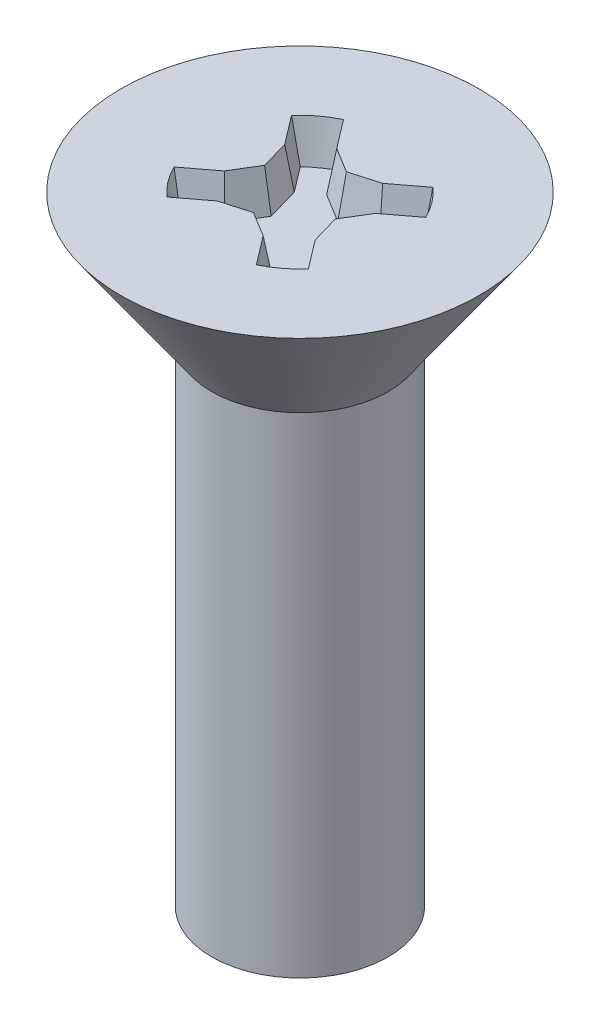
ISO-10303-21;
HEADER;
FILE_DESCRIPTION(('STEP AP214'),'2;1');
FILE_NAME('part.step','',(''),(''),'','','');
FILE_SCHEMA(('AUTOMOTIVE_DESIGN { 1 0 10303 214 1 1 1 1 }'));
ENDSEC;
DATA;
#1=APPLICATION_CONTEXT('core data for automotive mechanical design processes');
#2=APPLICATION_PROTOCOL_DEFINITION('international standard','automotive_design',2000,#1);
#3=PRODUCT_CONTEXT('',#1,'mechanical');
#4=PRODUCT('Part','Part','',(#3));
#5=PRODUCT_RELATED_PRODUCT_CATEGORY('part','',(#4));
#6=PRODUCT_DEFINITION_FORMATION('','',#4);
#7=PRODUCT_DEFINITION_CONTEXT('part definition',#1,'design');
#8=PRODUCT_DEFINITION('design','',#6,#7);
#9=PRODUCT_DEFINITION_SHAPE('','',#8);
#10=(LENGTH_UNIT() NAMED_UNIT(*) SI_UNIT(.MILLI.,.METRE.));
#11=(NAMED_UNIT(*) PLANE_ANGLE_UNIT() SI_UNIT($,.RADIAN.));
#12=(NAMED_UNIT(*) SI_UNIT($,.STERADIAN.) SOLID_ANGLE_UNIT());
#13=UNCERTAINTY_MEASURE_WITH_UNIT(LENGTH_MEASURE(1.E-05),#10,'distance_accuracy_value','');
#14=(GEOMETRIC_REPRESENTATION_CONTEXT(3) GLOBAL_UNCERTAINTY_ASSIGNED_CONTEXT((#13)) GLOBAL_UNIT_ASSIGNED_CONTEXT((#10,
#11,#12)) REPRESENTATION_CONTEXT('',''));
#15=CARTESIAN_POINT('',(0.,0.,0.));
#16=DIRECTION('',(0.,0.,1.));
#17=DIRECTION('',(1.,0.,0.));
#18=AXIS2_PLACEMENT_3D('',#15,#16,#17);
#19=CARTESIAN_POINT('',(-55.3720970236662,4.,26.6733675478979));
#20=DIRECTION('',(0.514943647231245,-0.17364817766693,-0.839451815513635));
#21=DIRECTION('',(0.265146006465246,-0.89898178277291,0.348610598659839));
#22=AXIS2_PLACEMENT_3D('',#19,#20,#21);
#23=PLANE('',#22);
#24=DIRECTION('',(0.852401712868348,0.,0.522887483020111));
#25=VECTOR('',#24,1.);
#26=CARTESIAN_POINT('',(-56.3593550571996,4.,26.0677553577152));
#27=LINE('',#26,#25);
#28=CARTESIAN_POINT('',(-55.3720970236662,4.,26.6733675478979));
#29=VERTEX_POINT('',#28);
#30=CARTESIAN_POINT('',(-54.8935125508018,4.,26.9669448913625));
#31=VERTEX_POINT('',#30);
#32=EDGE_CURVE('E37',#29,#31,#27,.T.);
#33=ORIENTED_EDGE('',*,*,#32,.F.);
#34=DIRECTION('',(-0.118460689054673,-0.984287244785133,0.13094153237985));
#35=VECTOR('',#34,1.);
#36=CARTESIAN_POINT('',(-55.3707765266803,4.01097198024387,26.6719079252989));
#37=LINE('',#36,#35);
#38=CARTESIAN_POINT('',(-55.4638050545667,3.238,26.7747378015531));
#39=VERTEX_POINT('',#38);
#40=EDGE_CURVE('E9',#29,#39,#37,.T.);
#41=ORIENTED_EDGE('',*,*,#40,.T.);
#42=DIRECTION('',(0.852401712868348,0.,0.522887483020111));
#43=VECTOR('',#42,1.);
#44=CARTESIAN_POINT('',(-55.2103705547585,3.238,26.9302017403446));
#45=LINE('',#44,#43);
#46=CARTESIAN_POINT('',(-54.9132976708213,3.238,27.1124347065745));
#47=VERTEX_POINT('',#46);
#48=EDGE_CURVE('E18',#39,#47,#45,.T.);
#49=ORIENTED_EDGE('',*,*,#48,.T.);
#50=DIRECTION('',(-0.0254957226715016,-0.981936963565237,0.187482713095742));
#51=VECTOR('',#50,1.);
#52=CARTESIAN_POINT('',(-54.8929664474664,4.02103251034859,26.9629291222758));
#53=LINE('',#52,#51);
#54=EDGE_CURVE('E389',#31,#47,#53,.T.);
#55=ORIENTED_EDGE('',*,*,#54,.F.);
#56=EDGE_LOOP('',(#33,#41,#49,#55));
#57=FACE_BOUND('',#56,.T.);
#58=ADVANCED_FACE('F14',(#57),#23,.F.);
#59=CARTESIAN_POINT('',(-55.7872635419585,4.,26.1275118874078));
#60=DIRECTION('',(0.78384789512428,-0.17364817766693,-0.596178486446962));
#61=DIRECTION('',(-0.60537550057201,0.,-0.79594001237982));
#62=AXIS2_PLACEMENT_3D('',#59,#60,#61);
#63=PLANE('',#62);
#64=DIRECTION('',(0.60537550057201,0.,0.79594001237982));
#65=VECTOR('',#64,1.);
#66=CARTESIAN_POINT('',(-56.2900299325088,4.,25.466481028477));
#67=LINE('',#66,#65);
#68=CARTESIAN_POINT('',(-55.7872635419585,4.,26.1275118874078));
#69=VERTEX_POINT('',#68);
#70=EDGE_CURVE('E290',#69,#29,#67,.T.);
#71=ORIENTED_EDGE('',*,*,#70,.F.);
#72=CARTESIAN_POINT('',(-55.787263541916,4.00000000000905,26.1275118874622));
#73=CARTESIAN_POINT('',(-55.8081011746266,3.60634389370737,26.2147745648814));
#74=CARTESIAN_POINT('',(-55.8253863471622,3.23800000000013,26.2993353146135));
#75=(BOUNDED_CURVE() B_SPLINE_CURVE(2,(#72,#73,#74),.UNSPECIFIED.,.F.,
.F.) B_SPLINE_CURVE_WITH_KNOTS((3,3),(95.373264001806,95.8888299746063),
.UNSPECIFIED.) CURVE() GEOMETRIC_REPRESENTATION_ITEM() RATIONAL_B_SPLINE_CURVE((1.,1.,1.)) REPRESENTATION_ITEM(''));
#76=CARTESIAN_POINT('',(-55.8253863472247,3.238,26.2993353145304));
#77=VERTEX_POINT('',#76);
#78=EDGE_CURVE('E321',#69,#77,#75,.T.);
#79=ORIENTED_EDGE('',*,*,#78,.T.);
#80=DIRECTION('',(0.60537550057201,0.,0.79594001237982));
#81=VECTOR('',#80,1.);
#82=CARTESIAN_POINT('',(-55.3590570595746,3.238,26.9124591337708));
#83=LINE('',#82,#81);
#84=EDGE_CURVE('E317',#77,#39,#83,.T.);
#85=ORIENTED_EDGE('',*,*,#84,.T.);
#86=ORIENTED_EDGE('',*,*,#40,.F.);
#87=EDGE_LOOP('',(#71,#79,#85,#86));
#88=FACE_BOUND('',#87,.T.);
#89=ADVANCED_FACE('F644',(#88),#63,.F.);
#90=CARTESIAN_POINT('',(-55.,4.,27.75));
#91=DIRECTION('',(0.,1.,0.));
#92=DIRECTION('',(0.436544051213542,0.,0.899682883770758));
#93=AXIS2_PLACEMENT_3D('',#90,#91,#92);
#94=CONICAL_SURFACE('',#93,1.80340000002629,0.1745329252);
#95=CARTESIAN_POINT('',(-55.,4.,27.75));
#96=DIRECTION('',(0.,-1.,0.));
#97=DIRECTION('',(0.436544051213542,0.,0.899682883770758));
#98=AXIS2_PLACEMENT_3D('',#95,#96,#97);
#99=CIRCLE('',#98,1.80340000002629);
#100=CARTESIAN_POINT('',(-56.353336078763,4.,26.5580549434146));
#101=VERTEX_POINT('',#100);
#102=EDGE_CURVE('E224',#101,#69,#99,.T.);
#103=ORIENTED_EDGE('',*,*,#102,.F.);
#104=CARTESIAN_POINT('',(-56.3533360788042,3.99999999999701,26.5580549433653));
#105=CARTESIAN_POINT('',(-56.2636778285467,3.60634389370379,26.5612767390242));
#106=CARTESIAN_POINT('',(-56.1775720384637,3.238,26.5672004623697));
#107=(BOUNDED_CURVE() B_SPLINE_CURVE(2,(#104,#105,#106),.UNSPECIFIED.,.F.,
.F.) B_SPLINE_CURVE_WITH_KNOTS((3,3),(95.3732640012774,95.8888299740268),
.UNSPECIFIED.) CURVE() GEOMETRIC_REPRESENTATION_ITEM() RATIONAL_B_SPLINE_CURVE((1.,1.,1.)) REPRESENTATION_ITEM(''));
#108=CARTESIAN_POINT('',(-56.1775720384362,3.238,26.5672004624001));
#109=VERTEX_POINT('',#108);
#110=EDGE_CURVE('E322',#101,#109,#107,.T.);
#111=ORIENTED_EDGE('',*,*,#110,.T.);
#112=CARTESIAN_POINT('',(-55.,3.238,27.75));
#113=DIRECTION('',(0.,-1.,0.));
#114=DIRECTION('',(0.436544051213542,0.,0.899682883770758));
#115=AXIS2_PLACEMENT_3D('',#112,#113,#114);
#116=CIRCLE('',#115,1.66903884072643);
#117=EDGE_CURVE('E288',#109,#77,#116,.T.);
#118=ORIENTED_EDGE('',*,*,#117,.T.);
#119=ORIENTED_EDGE('',*,*,#78,.F.);
#120=EDGE_LOOP('',(#103,#111,#118,#119));
#121=FACE_BOUND('',#120,.T.);
#122=ADVANCED_FACE('F626',(#121),#94,.F.);
#123=CARTESIAN_POINT('',(-55.9381695604707,4.,27.1039106039047));
#124=DIRECTION('',(-0.78384789512428,-0.173648177666931,0.596178486446962));
#125=DIRECTION('',(-0.13821353268195,0.984807753012208,0.105122352478536));
#126=AXIS2_PLACEMENT_3D('',#123,#124,#125);
#127=PLANE('',#126);
#128=DIRECTION('',(-0.60537550057201,0.,-0.79594001237982));
#129=VECTOR('',#128,1.);
#130=CARTESIAN_POINT('',(-56.6485192101672,4.,26.1699519147289));
#131=LINE('',#130,#129);
#132=CARTESIAN_POINT('',(-55.9381695604707,4.,27.1039106039047));
#133=VERTEX_POINT('',#132);
#134=EDGE_CURVE('E219',#133,#101,#131,.T.);
#135=ORIENTED_EDGE('',*,*,#134,.F.);
#136=DIRECTION('',(0.157820274127082,-0.984287244785133,-0.0791920502812255));
#137=VECTOR('',#136,1.);
#138=CARTESIAN_POINT('',(-55.9396098266512,4.00898259515987,27.104633309732));
#139=LINE('',#138,#137);
#140=CARTESIAN_POINT('',(-55.8159907457782,3.238,27.0426029494227));
#141=VERTEX_POINT('',#140);
#142=EDGE_CURVE('E284',#133,#141,#139,.T.);
#143=ORIENTED_EDGE('',*,*,#142,.T.);
#144=DIRECTION('',(-0.60537550057201,0.,-0.79594001237982));
#145=VECTOR('',#144,1.);
#146=CARTESIAN_POINT('',(-55.50365949164,3.238,27.4532521118855));
#147=LINE('',#146,#145);
#148=EDGE_CURVE('E289',#141,#109,#147,.T.);
#149=ORIENTED_EDGE('',*,*,#148,.T.);
#150=ORIENTED_EDGE('',*,*,#110,.F.);
#151=EDGE_LOOP('',(#135,#143,#149,#150));
#152=FACE_BOUND('',#151,.T.);
#153=ADVANCED_FACE('F602',(#152),#127,.F.);
#154=CARTESIAN_POINT('',(-55.7830551086375,4.,27.6435125508018));
#155=DIRECTION('',(-0.946478332793247,-0.173648177666931,0.27207549677593));
#156=DIRECTION('',(0.276272699868314,0.,0.961079286691516));
#157=AXIS2_PLACEMENT_3D('',#154,#155,#156);
#158=PLANE('',#157);
#159=DIRECTION('',(-0.276272699868314,0.,-0.961079286691515));
#160=VECTOR('',#159,1.);
#161=CARTESIAN_POINT('',(-56.1805934400274,4.,26.2605823657097));
#162=LINE('',#161,#160);
#163=CARTESIAN_POINT('',(-55.7830551086375,4.,27.6435125508018));
#164=VERTEX_POINT('',#163);
#165=EDGE_CURVE('E223',#164,#133,#162,.T.);
#166=ORIENTED_EDGE('',*,*,#165,.F.);
#167=DIRECTION('',(0.187482713095742,-0.981936963565237,0.0254957226715016));
#168=VECTOR('',#167,1.);
#169=CARTESIAN_POINT('',(-55.7870708777242,4.02103251034859,27.6429664474664));
#170=LINE('',#169,#168);
#171=CARTESIAN_POINT('',(-55.6375652934255,3.238,27.6632976708213));
#172=VERTEX_POINT('',#171);
#173=EDGE_CURVE('E341',#164,#172,#170,.T.);
#174=ORIENTED_EDGE('',*,*,#173,.T.);
#175=DIRECTION('',(-0.276272699868314,0.,-0.961079286691515));
#176=VECTOR('',#175,1.);
#177=CARTESIAN_POINT('',(-55.563511649014,3.238,27.9209106155015));
#178=LINE('',#177,#176);
#179=EDGE_CURVE('E337',#172,#141,#178,.T.);
#180=ORIENTED_EDGE('',*,*,#179,.T.);
#181=ORIENTED_EDGE('',*,*,#142,.F.);
#182=EDGE_LOOP('',(#166,#174,#180,#181));
#183=FACE_BOUND('',#182,.T.);
#184=ADVANCED_FACE('F596',(#183),#158,.F.);
#185=CARTESIAN_POINT('',(-53.9233675478979,4.,27.3779029763338));
#186=DIRECTION('',(0.839451815513635,-0.17364817766693,0.514943647231245));
#187=DIRECTION('',(-0.348610598659839,-0.89898178277291,0.265146006465246));
#188=AXIS2_PLACEMENT_3D('',#185,#186,#187);
#189=PLANE('',#188);
#190=DIRECTION('',(-0.522887483020111,0.,0.852401712868347));
#191=VECTOR('',#190,1.);
#192=CARTESIAN_POINT('',(-53.8290175088518,4.,27.2240952499993));
#193=LINE('',#192,#191);
#194=CARTESIAN_POINT('',(-53.9233675478979,4.,27.3779029763338));
#195=VERTEX_POINT('',#194);
#196=CARTESIAN_POINT('',(-54.2169448913625,4.,27.8564874491982));
#197=VERTEX_POINT('',#196);
#198=EDGE_CURVE('E251',#195,#197,#193,.T.);
#199=ORIENTED_EDGE('',*,*,#198,.F.);
#200=DIRECTION('',(-0.13094153237985,-0.984287244785133,-0.118460689054673));
#201=VECTOR('',#200,1.);
#202=CARTESIAN_POINT('',(-53.9219079252989,4.01097198024387,27.3792234733197));
#203=LINE('',#202,#201);
#204=CARTESIAN_POINT('',(-54.0247378015531,3.238,27.2861949454333));
#205=VERTEX_POINT('',#204);
#206=EDGE_CURVE('E342',#195,#205,#203,.T.);
#207=ORIENTED_EDGE('',*,*,#206,.T.);
#208=DIRECTION('',(-0.522887483020111,0.,0.852401712868348));
#209=VECTOR('',#208,1.);
#210=CARTESIAN_POINT('',(-54.4941563865451,3.238,28.0514326282869));
#211=LINE('',#210,#209);
#212=CARTESIAN_POINT('',(-54.3624347065745,3.238,27.8367023291787));
#213=VERTEX_POINT('',#212);
#214=EDGE_CURVE('E420',#205,#213,#211,.T.);
#215=ORIENTED_EDGE('',*,*,#214,.T.);
#216=DIRECTION('',(-0.187482713095742,-0.981936963565237,-0.0254957226715016));
#217=VECTOR('',#216,1.);
#218=CARTESIAN_POINT('',(-54.2129291222758,4.02103251034859,27.8570335525336));
#219=LINE('',#218,#217);
#220=EDGE_CURVE('E255',#197,#213,#219,.T.);
#221=ORIENTED_EDGE('',*,*,#220,.F.);
#222=EDGE_LOOP('',(#199,#207,#215,#221));
#223=FACE_BOUND('',#222,.T.);
#224=ADVANCED_FACE('F601',(#223),#189,.F.);
#225=CARTESIAN_POINT('',(-53.3775118874078,4.,26.9627364580415));
#226=DIRECTION('',(0.596178486446962,-0.17364817766693,0.78384789512428));
#227=DIRECTION('',(-0.79594001237982,0.,0.60537550057201));
#228=AXIS2_PLACEMENT_3D('',#225,#226,#227);
#229=PLANE('',#228);
#230=DIRECTION('',(-0.79594001237982,0.,0.60537550057201));
#231=VECTOR('',#230,1.);
#232=CARTESIAN_POINT('',(-54.0811201797022,4.,27.4978863632219));
#233=LINE('',#232,#231);
#234=CARTESIAN_POINT('',(-53.3775118874078,4.,26.9627364580415));
#235=VERTEX_POINT('',#234);
#236=EDGE_CURVE('E217',#235,#195,#233,.T.);
#237=ORIENTED_EDGE('',*,*,#236,.F.);
#238=CARTESIAN_POINT('',(-53.3775118874605,4.00000000001615,26.9627364580844));
#239=CARTESIAN_POINT('',(-53.4647745648806,3.60634389371063,26.9418988253735));
#240=CARTESIAN_POINT('',(-53.5493353146135,3.238,26.9246136528378));
#241=(BOUNDED_CURVE() B_SPLINE_CURVE(2,(#238,#239,#240),.UNSPECIFIED.,.F.,
.F.) B_SPLINE_CURVE_WITH_KNOTS((3,3),(95.3732640018013,95.8888299746063),
.UNSPECIFIED.) CURVE() GEOMETRIC_REPRESENTATION_ITEM() RATIONAL_B_SPLINE_CURVE((1.,1.,1.)) REPRESENTATION_ITEM(''));
#242=CARTESIAN_POINT('',(-53.5493353145304,3.238,26.9246136527753));
#243=VERTEX_POINT('',#242);
#244=EDGE_CURVE('E246',#235,#243,#241,.T.);
#245=ORIENTED_EDGE('',*,*,#244,.T.);
#246=DIRECTION('',(-0.79594001237982,0.,0.60537550057201));
#247=VECTOR('',#246,1.);
#248=CARTESIAN_POINT('',(-54.5317443540215,3.238,27.6718136361889));
#249=LINE('',#248,#247);
#250=EDGE_CURVE('E242',#243,#205,#249,.T.);
#251=ORIENTED_EDGE('',*,*,#250,.T.);
#252=ORIENTED_EDGE('',*,*,#206,.F.);
#253=EDGE_LOOP('',(#237,#245,#251,#252));
#254=FACE_BOUND('',#253,.T.);
#255=ADVANCED_FACE('F438',(#254),#229,.F.);
#256=CARTESIAN_POINT('',(-55.,4.,27.75));
#257=DIRECTION('',(0.,1.,0.));
#258=DIRECTION('',(-0.899682883770758,0.,0.436544051213542));
#259=AXIS2_PLACEMENT_3D('',#256,#257,#258);
#260=CONICAL_SURFACE('',#259,1.80340000002629,0.1745329252);
#261=CARTESIAN_POINT('',(-55.,4.,27.75));
#262=DIRECTION('',(0.,-1.,0.));
#263=DIRECTION('',(-0.899682883770758,0.,0.436544051213542));
#264=AXIS2_PLACEMENT_3D('',#261,#262,#263);
#265=CIRCLE('',#264,1.80340000002629);
#266=CARTESIAN_POINT('',(-53.8080549434146,4.,26.396663921237));
#267=VERTEX_POINT('',#266);
#268=EDGE_CURVE('E353',#267,#235,#265,.T.);
#269=ORIENTED_EDGE('',*,*,#268,.F.);
#270=CARTESIAN_POINT('',(-53.8080549433641,3.99999999999176,26.396663921196));
#271=CARTESIAN_POINT('',(-53.811276739023,3.60634389370139,26.4863221714528));
#272=CARTESIAN_POINT('',(-53.8172004623684,3.23800000000006,26.5724279615353));
#273=(BOUNDED_CURVE() B_SPLINE_CURVE(2,(#270,#271,#272),.UNSPECIFIED.,.F.,
.F.) B_SPLINE_CURVE_WITH_KNOTS((3,3),(95.3732640012751,95.8888299740206),
.UNSPECIFIED.) CURVE() GEOMETRIC_REPRESENTATION_ITEM() RATIONAL_B_SPLINE_CURVE((1.,1.,1.)) REPRESENTATION_ITEM(''));
#274=CARTESIAN_POINT('',(-53.8172004624001,3.238,26.5724279615638));
#275=VERTEX_POINT('',#274);
#276=EDGE_CURVE('E240',#267,#275,#273,.T.);
#277=ORIENTED_EDGE('',*,*,#276,.T.);
#278=CARTESIAN_POINT('',(-55.,3.238,27.75));
#279=DIRECTION('',(0.,-1.,0.));
#280=DIRECTION('',(-0.899682883770758,0.,0.436544051213542));
#281=AXIS2_PLACEMENT_3D('',#278,#279,#280);
#282=CIRCLE('',#281,1.66903884072643);
#283=EDGE_CURVE('E236',#275,#243,#282,.T.);
#284=ORIENTED_EDGE('',*,*,#283,.T.);
#285=ORIENTED_EDGE('',*,*,#244,.F.);
#286=EDGE_LOOP('',(#269,#277,#284,#285));
#287=FACE_BOUND('',#286,.T.);
#288=ADVANCED_FACE('F442',(#287),#260,.F.);
#289=CARTESIAN_POINT('',(-54.3539106039047,4.,26.8118304395293));
#290=DIRECTION('',(-0.596178486446962,-0.173648177666931,-0.78384789512428));
#291=DIRECTION('',(0.105122352478536,-0.984807753012208,0.13821353268195));
#292=AXIS2_PLACEMENT_3D('',#289,#290,#291);
#293=PLANE('',#292);
#294=DIRECTION('',(0.79594001237982,0.,-0.60537550057201));
#295=VECTOR('',#294,1.);
#296=CARTESIAN_POINT('',(-54.7845910659541,4.,27.1393970855635));
#297=LINE('',#296,#295);
#298=CARTESIAN_POINT('',(-54.3539106039047,4.,26.8118304395293));
#299=VERTEX_POINT('',#298);
#300=EDGE_CURVE('E272',#299,#267,#297,.T.);
#301=ORIENTED_EDGE('',*,*,#300,.F.);
#302=DIRECTION('',(0.0791920502812254,-0.984287244785133,0.157820274127082));
#303=VECTOR('',#302,1.);
#304=CARTESIAN_POINT('',(-54.354633309732,4.00898259515987,26.8103901733488));
#305=LINE('',#304,#303);
#306=CARTESIAN_POINT('',(-54.2926029494227,3.238,26.9340092542218));
#307=VERTEX_POINT('',#306);
#308=EDGE_CURVE('E241',#299,#307,#305,.T.);
#309=ORIENTED_EDGE('',*,*,#308,.T.);
#310=DIRECTION('',(0.79594001237982,0.,-0.60537550057201));
#311=VECTOR('',#310,1.);
#312=CARTESIAN_POINT('',(-55.0725373321362,3.238,27.5272112041235));
#313=LINE('',#312,#311);
#314=EDGE_CURVE('E249',#307,#275,#313,.T.);
#315=ORIENTED_EDGE('',*,*,#314,.T.);
#316=ORIENTED_EDGE('',*,*,#276,.F.);
#317=EDGE_LOOP('',(#301,#309,#315,#316));
#318=FACE_BOUND('',#317,.T.);
#319=ADVANCED_FACE('F503',(#318),#293,.F.);
#320=CARTESIAN_POINT('',(-54.8935125508018,4.,26.9669448913625));
#321=DIRECTION('',(-0.27207549677593,-0.173648177666931,-0.946478332793247));
#322=DIRECTION('',(0.112511401725001,-0.982577389019048,0.147928560698692));
#323=AXIS2_PLACEMENT_3D('',#320,#321,#322);
#324=PLANE('',#323);
#325=DIRECTION('',(0.961079286691515,0.,-0.276272699868314));
#326=VECTOR('',#325,1.);
#327=CARTESIAN_POINT('',(-55.6430074702463,4.,27.1823953623068));
#328=LINE('',#327,#326);
#329=EDGE_CURVE('E268',#31,#299,#328,.T.);
#330=ORIENTED_EDGE('',*,*,#329,.F.);
#331=ORIENTED_EDGE('',*,*,#54,.T.);
#332=DIRECTION('',(0.961079286691515,0.,-0.276272699868314));
#333=VECTOR('',#332,1.);
#334=CARTESIAN_POINT('',(-55.4252061384036,3.238,27.2595883664055));
#335=LINE('',#334,#333);
#336=EDGE_CURVE('E364',#47,#307,#335,.T.);
#337=ORIENTED_EDGE('',*,*,#336,.T.);
#338=ORIENTED_EDGE('',*,*,#308,.F.);
#339=EDGE_LOOP('',(#330,#331,#337,#338));
#340=FACE_BOUND('',#339,.T.);
#341=ADVANCED_FACE('F495',(#340),#324,.F.);
#342=CARTESIAN_POINT('',(-54.6279029763338,4.,28.8266324521021));
#343=DIRECTION('',(-0.514943647231245,-0.17364817766693,0.839451815513635));
#344=DIRECTION('',(-0.147928560698692,0.982577389019048,0.112511401725));
#345=AXIS2_PLACEMENT_3D('',#342,#343,#344);
#346=PLANE('',#345);
#347=DIRECTION('',(-0.852401712868348,0.,-0.522887483020111));
#348=VECTOR('',#347,1.);
#349=CARTESIAN_POINT('',(-56.3653885458186,4.,27.7608093284547));
#350=LINE('',#349,#348);
#351=CARTESIAN_POINT('',(-54.6279029763338,4.,28.8266324521021));
#352=VERTEX_POINT('',#351);
#353=CARTESIAN_POINT('',(-55.1064874491982,4.,28.5330551086375));
#354=VERTEX_POINT('',#353);
#355=EDGE_CURVE('E195',#352,#354,#350,.T.);
#356=ORIENTED_EDGE('',*,*,#355,.F.);
#357=DIRECTION('',(0.118460689054673,-0.984287244785133,-0.13094153237985));
#358=VECTOR('',#357,1.);
#359=CARTESIAN_POINT('',(-54.6292234733197,4.01097198024387,28.8280920747011));
#360=LINE('',#359,#358);
#361=CARTESIAN_POINT('',(-54.5361949454333,3.238,28.7252621984469));
#362=VERTEX_POINT('',#361);
#363=EDGE_CURVE('E192',#352,#362,#360,.T.);
#364=ORIENTED_EDGE('',*,*,#363,.T.);
#365=DIRECTION('',(-0.852401712868348,0.,-0.522887483020111));
#366=VECTOR('',#365,1.);
#367=CARTESIAN_POINT('',(-55.0758925065736,3.238,28.3941963464238));
#368=LINE('',#367,#366);
#369=CARTESIAN_POINT('',(-55.0867023291787,3.238,28.3875652934255));
#370=VERTEX_POINT('',#369);
#371=EDGE_CURVE('E199',#362,#370,#368,.T.);
#372=ORIENTED_EDGE('',*,*,#371,.T.);
#373=DIRECTION('',(0.0254957226715016,-0.981936963565237,-0.187482713095742));
#374=VECTOR('',#373,1.);
#375=CARTESIAN_POINT('',(-55.1070335525336,4.02103251034859,28.5370708777242));
#376=LINE('',#375,#374);
#377=EDGE_CURVE('E177',#354,#370,#376,.T.);
#378=ORIENTED_EDGE('',*,*,#377,.F.);
#379=EDGE_LOOP('',(#356,#364,#372,#378));
#380=FACE_BOUND('',#379,.T.);
#381=ADVANCED_FACE('F618',(#380),#346,.F.);
#382=CARTESIAN_POINT('',(-54.2127364580415,4.,29.3724881125922));
#383=DIRECTION('',(-0.78384789512428,-0.17364817766693,0.596178486446962));
#384=DIRECTION('',(-0.138213532681949,0.984807753012208,0.105122352478535));
#385=AXIS2_PLACEMENT_3D('',#382,#383,#384);
#386=PLANE('',#385);
#387=DIRECTION('',(-0.60537550057201,0.,-0.79594001237982));
#388=VECTOR('',#387,1.);
#389=CARTESIAN_POINT('',(-55.7858026589526,4.,27.3042406690726));
#390=LINE('',#389,#388);
#391=CARTESIAN_POINT('',(-54.2127364580415,4.,29.3724881125922));
#392=VERTEX_POINT('',#391);
#393=EDGE_CURVE('E187',#392,#352,#390,.T.);
#394=ORIENTED_EDGE('',*,*,#393,.F.);
#395=CARTESIAN_POINT('',(-54.2127364580844,4.00000000001615,29.3724881125395));
#396=CARTESIAN_POINT('',(-54.1918988253735,3.60634389371063,29.2852254351194));
#397=CARTESIAN_POINT('',(-54.1746136528378,3.238,29.2006646853865));
#398=(BOUNDED_CURVE() B_SPLINE_CURVE(2,(#395,#396,#397),.UNSPECIFIED.,.F.,
.F.) B_SPLINE_CURVE_WITH_KNOTS((3,3),(95.3732640018013,95.8888299746063),
.UNSPECIFIED.) CURVE() GEOMETRIC_REPRESENTATION_ITEM() RATIONAL_B_SPLINE_CURVE((1.,1.,1.)) REPRESENTATION_ITEM(''));
#399=CARTESIAN_POINT('',(-54.1746136527753,3.238,29.2006646854696));
#400=VERTEX_POINT('',#399);
#401=EDGE_CURVE('E190',#392,#400,#398,.T.);
#402=ORIENTED_EDGE('',*,*,#401,.T.);
#403=DIRECTION('',(-0.60537550057201,0.,-0.79594001237982));
#404=VECTOR('',#403,1.);
#405=CARTESIAN_POINT('',(-54.6409429404254,3.238,28.5875408662292));
#406=LINE('',#405,#404);
#407=EDGE_CURVE('E200',#400,#362,#406,.T.);
#408=ORIENTED_EDGE('',*,*,#407,.T.);
#409=ORIENTED_EDGE('',*,*,#363,.F.);
#410=EDGE_LOOP('',(#394,#402,#408,#409));
#411=FACE_BOUND('',#410,.T.);
#412=ADVANCED_FACE('F188',(#411),#386,.F.);
#413=CARTESIAN_POINT('',(-55.,4.,27.75));
#414=DIRECTION('',(0.,1.,0.));
#415=DIRECTION('',(-0.436544051213542,0.,-0.899682883770758));
#416=AXIS2_PLACEMENT_3D('',#413,#414,#415);
#417=CONICAL_SURFACE('',#416,1.80340000002629,0.1745329252);
#418=CARTESIAN_POINT('',(-55.,4.,27.75));
#419=DIRECTION('',(0.,-1.,0.));
#420=DIRECTION('',(-0.436544051213542,0.,-0.899682883770758));
#421=AXIS2_PLACEMENT_3D('',#418,#419,#420);
#422=CIRCLE('',#421,1.80340000002629);
#423=CARTESIAN_POINT('',(-53.646663921237,4.,28.9419450565854));
#424=VERTEX_POINT('',#423);
#425=EDGE_CURVE('E151',#424,#392,#422,.T.);
#426=ORIENTED_EDGE('',*,*,#425,.F.);
#427=CARTESIAN_POINT('',(-53.6466639211953,3.99999999999482,28.9419450566359));
#428=CARTESIAN_POINT('',(-53.7363221714525,3.60634389370286,28.9387232609771));
#429=CARTESIAN_POINT('',(-53.8224279615353,3.23800000000012,28.9327995376317));
#430=(BOUNDED_CURVE() B_SPLINE_CURVE(2,(#427,#428,#429),.UNSPECIFIED.,.F.,
.F.) B_SPLINE_CURVE_WITH_KNOTS((3,3),(95.3732640012729,95.8888299740204),
.UNSPECIFIED.) CURVE() GEOMETRIC_REPRESENTATION_ITEM() RATIONAL_B_SPLINE_CURVE((1.,1.,1.)) REPRESENTATION_ITEM(''));
#431=CARTESIAN_POINT('',(-53.8224279615638,3.238,28.9327995375999));
#432=VERTEX_POINT('',#431);
#433=EDGE_CURVE('E262',#424,#432,#430,.T.);
#434=ORIENTED_EDGE('',*,*,#433,.T.);
#435=CARTESIAN_POINT('',(-55.,3.238,27.75));
#436=DIRECTION('',(0.,-1.,0.));
#437=DIRECTION('',(-0.436544051213542,0.,-0.899682883770758));
#438=AXIS2_PLACEMENT_3D('',#435,#436,#437);
#439=CIRCLE('',#438,1.66903884072643);
#440=EDGE_CURVE('E162',#432,#400,#439,.T.);
#441=ORIENTED_EDGE('',*,*,#440,.T.);
#442=ORIENTED_EDGE('',*,*,#401,.F.);
#443=EDGE_LOOP('',(#426,#434,#441,#442));
#444=FACE_BOUND('',#443,.T.);
#445=ADVANCED_FACE('F197',(#444),#417,.F.);
#446=CARTESIAN_POINT('',(-54.0618304395293,4.,28.3960893960953));
#447=DIRECTION('',(0.78384789512428,-0.173648177666931,-0.596178486446962));
#448=DIRECTION('',(-0.60537550057201,0.,-0.79594001237982));
#449=AXIS2_PLACEMENT_3D('',#446,#447,#448);
#450=PLANE('',#449);
#451=DIRECTION('',(0.60537550057201,0.,0.79594001237982));
#452=VECTOR('',#451,1.);
#453=CARTESIAN_POINT('',(-55.4273133812942,4.,26.6007697828207));
#454=LINE('',#453,#452);
#455=CARTESIAN_POINT('',(-54.0618304395293,4.,28.3960893960953));
#456=VERTEX_POINT('',#455);
#457=EDGE_CURVE('E206',#456,#424,#454,.T.);
#458=ORIENTED_EDGE('',*,*,#457,.F.);
#459=DIRECTION('',(-0.157820274127082,-0.984287244785133,0.0791920502812256));
#460=VECTOR('',#459,1.);
#461=CARTESIAN_POINT('',(-54.0603901733488,4.00898259515987,28.395366690268));
#462=LINE('',#461,#460);
#463=CARTESIAN_POINT('',(-54.1840092542218,3.238,28.4573970505773));
#464=VERTEX_POINT('',#463);
#465=EDGE_CURVE('E231',#456,#464,#462,.T.);
#466=ORIENTED_EDGE('',*,*,#465,.T.);
#467=DIRECTION('',(0.60537550057201,0.,0.79594001237982));
#468=VECTOR('',#467,1.);
#469=CARTESIAN_POINT('',(-54.49634050836,3.238,28.0467478881145));
#470=LINE('',#469,#468);
#471=EDGE_CURVE('E234',#464,#432,#470,.T.);
#472=ORIENTED_EDGE('',*,*,#471,.T.);
#473=ORIENTED_EDGE('',*,*,#433,.F.);
#474=EDGE_LOOP('',(#458,#466,#472,#473));
#475=FACE_BOUND('',#474,.T.);
#476=ADVANCED_FACE('F550',(#475),#450,.F.);
#477=CARTESIAN_POINT('',(-54.2169448913625,4.,27.8564874491982));
#478=DIRECTION('',(0.946478332793247,-0.173648177666931,-0.272075496775931));
#479=DIRECTION('',(-0.265146006465248,-0.898981782772909,-0.348610598659841));
#480=AXIS2_PLACEMENT_3D('',#477,#478,#479);
#481=PLANE('',#480);
#482=DIRECTION('',(0.276272699868314,0.,0.961079286691515));
#483=VECTOR('',#482,1.);
#484=CARTESIAN_POINT('',(-54.7025257047261,4.,26.1672808719249));
#485=LINE('',#484,#483);
#486=EDGE_CURVE('E213',#197,#456,#485,.T.);
#487=ORIENTED_EDGE('',*,*,#486,.F.);
#488=ORIENTED_EDGE('',*,*,#220,.T.);
#489=DIRECTION('',(0.276272699868314,0.,0.961079286691515));
#490=VECTOR('',#489,1.);
#491=CARTESIAN_POINT('',(-54.3437073679907,3.238,27.9018497621911));
#492=LINE('',#491,#490);
#493=EDGE_CURVE('E259',#213,#464,#492,.T.);
#494=ORIENTED_EDGE('',*,*,#493,.T.);
#495=ORIENTED_EDGE('',*,*,#465,.F.);
#496=EDGE_LOOP('',(#487,#488,#494,#495));
#497=FACE_BOUND('',#496,.T.);
#498=ADVANCED_FACE('F16',(#497),#481,.F.);
#499=CARTESIAN_POINT('',(-57.0758325914614,4.,25.0207216975496));
#500=DIRECTION('',(0.,1.,0.));
#501=DIRECTION('',(0.79594001237982,0.,-0.60537550057201));
#502=AXIS2_PLACEMENT_3D('',#499,#500,#501);
#503=PLANE('',#502);
#504=CARTESIAN_POINT('',(-55.,4.,27.75));
#505=DIRECTION('',(0.,-1.,0.));
#506=DIRECTION('',(0.79594001237982,0.,-0.60537550057201));
#507=AXIS2_PLACEMENT_3D('',#504,#505,#506);
#508=CIRCLE('',#507,3.429);
#509=CARTESIAN_POINT('',(-57.0758325914614,4.,25.0207216975496));
#510=VERTEX_POINT('',#509);
#511=EDGE_CURVE('E312',#510,#510,#508,.T.);
#512=ORIENTED_EDGE('',*,*,#511,.F.);
#513=EDGE_LOOP('',(#512));
#514=FACE_BOUND('',#513,.T.);
#515=ORIENTED_EDGE('',*,*,#165,.T.);
#516=ORIENTED_EDGE('',*,*,#134,.T.);
#517=ORIENTED_EDGE('',*,*,#102,.T.);
#518=ORIENTED_EDGE('',*,*,#70,.T.);
#519=ORIENTED_EDGE('',*,*,#32,.T.);
#520=ORIENTED_EDGE('',*,*,#329,.T.);
#521=ORIENTED_EDGE('',*,*,#300,.T.);
#522=ORIENTED_EDGE('',*,*,#268,.T.);
#523=ORIENTED_EDGE('',*,*,#236,.T.);
#524=ORIENTED_EDGE('',*,*,#198,.T.);
#525=ORIENTED_EDGE('',*,*,#486,.T.);
#526=ORIENTED_EDGE('',*,*,#457,.T.);
#527=ORIENTED_EDGE('',*,*,#425,.T.);
#528=ORIENTED_EDGE('',*,*,#393,.T.);
#529=ORIENTED_EDGE('',*,*,#355,.T.);
#530=DIRECTION('',(-0.961079286691515,0.,0.276272699868314));
#531=VECTOR('',#530,1.);
#532=CARTESIAN_POINT('',(-55.5497059764615,4.,28.6604630976081));
#533=LINE('',#532,#531);
#534=CARTESIAN_POINT('',(-55.6460893960953,4.,28.6881695604707));
#535=VERTEX_POINT('',#534);
#536=EDGE_CURVE('E276',#354,#535,#533,.T.);
#537=ORIENTED_EDGE('',*,*,#536,.T.);
#538=DIRECTION('',(-0.79594001237982,0.,0.60537550057201));
#539=VECTOR('',#538,1.);
#540=CARTESIAN_POINT('',(-55.2154089340459,4.,28.3606029144365));
#541=LINE('',#540,#539);
#542=CARTESIAN_POINT('',(-56.1919450565854,4.,29.103336078763));
#543=VERTEX_POINT('',#542);
#544=EDGE_CURVE('E267',#535,#543,#541,.T.);
#545=ORIENTED_EDGE('',*,*,#544,.T.);
#546=CARTESIAN_POINT('',(-55.,4.,27.75));
#547=DIRECTION('',(0.,-1.,0.));
#548=DIRECTION('',(0.899682883770758,0.,-0.436544051213542));
#549=AXIS2_PLACEMENT_3D('',#546,#547,#548);
#550=CIRCLE('',#549,1.80340000002628);
#551=CARTESIAN_POINT('',(-56.6224881125922,4.,28.5372635419585));
#552=VERTEX_POINT('',#551);
#553=EDGE_CURVE('E263',#543,#552,#550,.T.);
#554=ORIENTED_EDGE('',*,*,#553,.T.);
#555=DIRECTION('',(0.79594001237982,0.,-0.60537550057201));
#556=VECTOR('',#555,1.);
#557=CARTESIAN_POINT('',(-55.9188798202978,4.,28.0021136367781));
#558=LINE('',#557,#556);
#559=CARTESIAN_POINT('',(-56.0766324521021,4.,28.1220970236662));
#560=VERTEX_POINT('',#559);
#561=EDGE_CURVE('E229',#552,#560,#558,.T.);
#562=ORIENTED_EDGE('',*,*,#561,.T.);
#563=DIRECTION('',(0.522887483020111,0.,-0.852401712868348));
#564=VECTOR('',#563,1.);
#565=CARTESIAN_POINT('',(-55.5220714795913,4.,27.2180617613803));
#566=LINE('',#565,#564);
#567=EDGE_CURVE('E225',#560,#164,#566,.T.);
#568=ORIENTED_EDGE('',*,*,#567,.T.);
#569=EDGE_LOOP('',(#515,#516,#517,#518,#519,#520,#521,#522,#523,#524,#525,#526,#527,#528,#529,
#537,#545,#554,#562,#568));
#570=FACE_BOUND('',#569,.T.);
#571=ADVANCED_FACE('F204',(#514,#570),#503,.T.);
#572=CARTESIAN_POINT('',(-56.0766324521021,4.,28.1220970236662));
#573=DIRECTION('',(-0.839451815513635,-0.17364817766693,-0.514943647231245));
#574=DIRECTION('',(-0.522887483020111,0.,0.852401712868348));
#575=AXIS2_PLACEMENT_3D('',#572,#573,#574);
#576=PLANE('',#575);
#577=ORIENTED_EDGE('',*,*,#567,.F.);
#578=DIRECTION('',(0.13094153237985,-0.984287244785133,0.118460689054673));
#579=VECTOR('',#578,1.);
#580=CARTESIAN_POINT('',(-56.0780920747011,4.01097198024387,28.1207765266803));
#581=LINE('',#580,#579);
#582=CARTESIAN_POINT('',(-55.9752621984469,3.238,28.2138050545667));
#583=VERTEX_POINT('',#582);
#584=EDGE_CURVE('E230',#560,#583,#581,.T.);
#585=ORIENTED_EDGE('',*,*,#584,.T.);
#586=DIRECTION('',(0.522887483020111,0.,-0.852401712868348));
#587=VECTOR('',#586,1.);
#588=CARTESIAN_POINT('',(-55.9581509926243,3.238,28.1859106764718));
#589=LINE('',#588,#587);
#590=EDGE_CURVE('E345',#583,#172,#589,.T.);
#591=ORIENTED_EDGE('',*,*,#590,.T.);
#592=ORIENTED_EDGE('',*,*,#173,.F.);
#593=EDGE_LOOP('',(#577,#585,#591,#592));
#594=FACE_BOUND('',#593,.T.);
#595=ADVANCED_FACE('F522',(#594),#576,.F.);
#596=CARTESIAN_POINT('',(-56.6224881125922,4.,28.5372635419585));
#597=DIRECTION('',(-0.596178486446962,-0.17364817766693,-0.78384789512428));
#598=DIRECTION('',(0.105122352478535,-0.984807753012208,0.138213532681949));
#599=AXIS2_PLACEMENT_3D('',#596,#597,#598);
#600=PLANE('',#599);
#601=ORIENTED_EDGE('',*,*,#561,.F.);
#602=CARTESIAN_POINT('',(-56.6224881125402,4.00000000001918,28.5372635419154));
#603=CARTESIAN_POINT('',(-56.5352254351198,3.60634389371207,28.5581011746264));
#604=CARTESIAN_POINT('',(-56.4506646853866,3.2380000000001,28.5753863471623));
#605=(BOUNDED_CURVE() B_SPLINE_CURVE(2,(#602,#603,#604),.UNSPECIFIED.,.F.,
.F.) B_SPLINE_CURVE_WITH_KNOTS((3,3),(95.3732640017992,95.8888299746061),
.UNSPECIFIED.) CURVE() GEOMETRIC_REPRESENTATION_ITEM() RATIONAL_B_SPLINE_CURVE((1.,1.,1.)) REPRESENTATION_ITEM(''));
#606=CARTESIAN_POINT('',(-56.4506646854696,3.238,28.5753863472247));
#607=VERTEX_POINT('',#606);
#608=EDGE_CURVE('E361',#552,#607,#605,.T.);
#609=ORIENTED_EDGE('',*,*,#608,.T.);
#610=DIRECTION('',(0.79594001237982,0.,-0.60537550057201));
#611=VECTOR('',#610,1.);
#612=CARTESIAN_POINT('',(-56.20682608648,3.238,28.3899277553381));
#613=LINE('',#612,#611);
#614=EDGE_CURVE('E357',#607,#583,#613,.T.);
#615=ORIENTED_EDGE('',*,*,#614,.T.);
#616=ORIENTED_EDGE('',*,*,#584,.F.);
#617=EDGE_LOOP('',(#601,#609,#615,#616));
#618=FACE_BOUND('',#617,.T.);
#619=ADVANCED_FACE('F516',(#618),#600,.F.);
#620=CARTESIAN_POINT('',(-55.,4.,27.75));
#621=DIRECTION('',(0.,1.,0.));
#622=DIRECTION('',(0.899682883770758,0.,-0.436544051213542));
#623=AXIS2_PLACEMENT_3D('',#620,#621,#622);
#624=CONICAL_SURFACE('',#623,1.80340000002628,0.1745329252);
#625=ORIENTED_EDGE('',*,*,#553,.F.);
#626=CARTESIAN_POINT('',(-56.1919450566359,3.99999999999482,29.1033360788047));
#627=CARTESIAN_POINT('',(-56.1887232609771,3.60634389370286,29.0136778285475));
#628=CARTESIAN_POINT('',(-56.1827995376317,3.23800000000012,28.9275720384647));
#629=(BOUNDED_CURVE() B_SPLINE_CURVE(2,(#626,#627,#628),.UNSPECIFIED.,.F.,
.F.) B_SPLINE_CURVE_WITH_KNOTS((3,3),(95.3732640012729,95.8888299740204),
.UNSPECIFIED.) CURVE() GEOMETRIC_REPRESENTATION_ITEM() RATIONAL_B_SPLINE_CURVE((1.,1.,1.)) REPRESENTATION_ITEM(''));
#630=CARTESIAN_POINT('',(-56.1827995375999,3.238,28.9275720384362));
#631=VERTEX_POINT('',#630);
#632=EDGE_CURVE('E298',#543,#631,#629,.T.);
#633=ORIENTED_EDGE('',*,*,#632,.T.);
#634=CARTESIAN_POINT('',(-55.,3.238,27.75));
#635=DIRECTION('',(0.,-1.,0.));
#636=DIRECTION('',(0.899682883770758,0.,-0.436544051213542));
#637=AXIS2_PLACEMENT_3D('',#634,#635,#636);
#638=CIRCLE('',#637,1.66903884072643);
#639=EDGE_CURVE('E294',#631,#607,#638,.T.);
#640=ORIENTED_EDGE('',*,*,#639,.T.);
#641=ORIENTED_EDGE('',*,*,#608,.F.);
#642=EDGE_LOOP('',(#625,#633,#640,#641));
#643=FACE_BOUND('',#642,.T.);
#644=ADVANCED_FACE('F519',(#643),#624,.F.);
#645=CARTESIAN_POINT('',(-55.6460893960953,4.,28.6881695604707));
#646=DIRECTION('',(0.596178486446962,-0.173648177666931,0.78384789512428));
#647=DIRECTION('',(-0.79594001237982,0.,0.60537550057201));
#648=AXIS2_PLACEMENT_3D('',#645,#646,#647);
#649=PLANE('',#648);
#650=ORIENTED_EDGE('',*,*,#544,.F.);
#651=DIRECTION('',(-0.0791920502812255,-0.984287244785133,-0.157820274127082));
#652=VECTOR('',#651,1.);
#653=CARTESIAN_POINT('',(-55.645366690268,4.00898259515987,28.6896098266512));
#654=LINE('',#653,#652);
#655=CARTESIAN_POINT('',(-55.7073970505773,3.238,28.5659907457782));
#656=VERTEX_POINT('',#655);
#657=EDGE_CURVE('E299',#535,#656,#654,.T.);
#658=ORIENTED_EDGE('',*,*,#657,.T.);
#659=DIRECTION('',(-0.79594001237982,0.,0.60537550057201));
#660=VECTOR('',#659,1.);
#661=CARTESIAN_POINT('',(-55.6660331083653,3.238,28.5345301874035));
#662=LINE('',#661,#660);
#663=EDGE_CURVE('E282',#656,#631,#662,.T.);
#664=ORIENTED_EDGE('',*,*,#663,.T.);
#665=ORIENTED_EDGE('',*,*,#632,.F.);
#666=EDGE_LOOP('',(#650,#658,#664,#665));
#667=FACE_BOUND('',#666,.T.);
#668=ADVANCED_FACE('F568',(#667),#649,.F.);
#669=CARTESIAN_POINT('',(-55.1064874491982,4.,28.5330551086375));
#670=DIRECTION('',(0.27207549677593,-0.173648177666931,0.946478332793247));
#671=DIRECTION('',(-0.34861059865984,0.89898178277291,0.265146006465247));
#672=AXIS2_PLACEMENT_3D('',#669,#670,#671);
#673=PLANE('',#672);
#674=ORIENTED_EDGE('',*,*,#536,.F.);
#675=ORIENTED_EDGE('',*,*,#377,.T.);
#676=DIRECTION('',(-0.961079286691515,0.,0.276272699868314));
#677=VECTOR('',#676,1.);
#678=CARTESIAN_POINT('',(-55.4061452850932,3.238,28.4793926474289));
#679=LINE('',#678,#677);
#680=EDGE_CURVE('E283',#370,#656,#679,.T.);
#681=ORIENTED_EDGE('',*,*,#680,.T.);
#682=ORIENTED_EDGE('',*,*,#657,.F.);
#683=EDGE_LOOP('',(#674,#675,#681,#682));
#684=FACE_BOUND('',#683,.T.);
#685=ADVANCED_FACE('F573',(#684),#673,.F.);
#686=CARTESIAN_POINT('',(-55.7385704405015,3.238,28.311741391527));
#687=DIRECTION('',(0.,1.,0.));
#688=DIRECTION('',(0.79594001237982,0.,-0.60537550057201));
#689=AXIS2_PLACEMENT_3D('',#686,#687,#688);
#690=PLANE('',#689);
#691=ORIENTED_EDGE('',*,*,#680,.F.);
#692=ORIENTED_EDGE('',*,*,#371,.F.);
#693=ORIENTED_EDGE('',*,*,#407,.F.);
#694=ORIENTED_EDGE('',*,*,#440,.F.);
#695=ORIENTED_EDGE('',*,*,#471,.F.);
#696=ORIENTED_EDGE('',*,*,#493,.F.);
#697=ORIENTED_EDGE('',*,*,#214,.F.);
#698=ORIENTED_EDGE('',*,*,#250,.F.);
#699=ORIENTED_EDGE('',*,*,#283,.F.);
#700=ORIENTED_EDGE('',*,*,#314,.F.);
#701=ORIENTED_EDGE('',*,*,#336,.F.);
#702=ORIENTED_EDGE('',*,*,#48,.F.);
#703=ORIENTED_EDGE('',*,*,#84,.F.);
#704=ORIENTED_EDGE('',*,*,#117,.F.);
#705=ORIENTED_EDGE('',*,*,#148,.F.);
#706=ORIENTED_EDGE('',*,*,#179,.F.);
#707=ORIENTED_EDGE('',*,*,#590,.F.);
#708=ORIENTED_EDGE('',*,*,#614,.F.);
#709=ORIENTED_EDGE('',*,*,#639,.F.);
#710=ORIENTED_EDGE('',*,*,#663,.F.);
#711=EDGE_LOOP('',(#691,#692,#693,#694,#695,#696,#697,#698,#699,#700,#701,#702,#703,#704,#705,
#706,#707,#708,#709,#710));
#712=FACE_BOUND('',#711,.T.);
#713=ADVANCED_FACE('F499',(#712),#690,.T.);
#714=CARTESIAN_POINT('',(-55.,-3.1501,27.75));
#715=DIRECTION('',(0.,-1.,0.));
#716=DIRECTION('',(-0.60537550057201,0.,-0.79594001237982));
#717=AXIS2_PLACEMENT_3D('',#714,#715,#716);
#718=CYLINDRICAL_SURFACE('',#717,1.6891);
#719=CARTESIAN_POINT('',(-55.,1.5362,27.75));
#720=DIRECTION('',(0.,-1.,0.));
#721=DIRECTION('',(0.79594001237982,0.,-0.60537550057201));
#722=AXIS2_PLACEMENT_3D('',#719,#720,#721);
#723=CIRCLE('',#722,1.6891);
#724=CARTESIAN_POINT('',(-56.0225397580162,1.5362,26.4055777250892));
#725=VERTEX_POINT('',#724);
#726=EDGE_CURVE('E311',#725,#725,#723,.T.);
#727=ORIENTED_EDGE('',*,*,#726,.T.);
#728=EDGE_LOOP('',(#727));
#729=FACE_BOUND('',#728,.T.);
#730=CARTESIAN_POINT('',(-55.,-7.8364,27.75));
#731=DIRECTION('',(0.,-1.,0.));
#732=DIRECTION('',(0.79594001237982,0.,-0.60537550057201));
#733=AXIS2_PLACEMENT_3D('',#730,#731,#732);
#734=CIRCLE('',#733,1.6891);
#735=CARTESIAN_POINT('',(-56.0225397580162,-7.8364,26.4055777250892));
#736=VERTEX_POINT('',#735);
#737=EDGE_CURVE('E316',#736,#736,#734,.T.);
#738=ORIENTED_EDGE('',*,*,#737,.F.);
#739=EDGE_LOOP('',(#738));
#740=FACE_BOUND('',#739,.T.);
#741=ADVANCED_FACE('F562',(#729,#740),#718,.T.);
#742=CARTESIAN_POINT('',(-55.,-7.8364,27.75));
#743=DIRECTION('',(0.,-1.,0.));
#744=DIRECTION('',(-0.60537550057201,0.,-0.79594001237982));
#745=AXIS2_PLACEMENT_3D('',#742,#743,#744);
#746=PLANE('',#745);
#747=ORIENTED_EDGE('',*,*,#737,.T.);
#748=EDGE_LOOP('',(#747));
#749=FACE_BOUND('',#748,.T.);
#750=ADVANCED_FACE('F556',(#749),#746,.T.);
#751=CARTESIAN_POINT('',(-55.,2.7681,27.75));
#752=DIRECTION('',(0.,1.,0.));
#753=DIRECTION('',(-0.60537550057201,0.,-0.79594001237982));
#754=AXIS2_PLACEMENT_3D('',#751,#752,#753);
#755=CONICAL_SURFACE('',#754,2.55905,0.614865299149245);
#756=ORIENTED_EDGE('',*,*,#511,.T.);
#757=EDGE_LOOP('',(#756));
#758=FACE_BOUND('',#757,.T.);
#759=ORIENTED_EDGE('',*,*,#726,.F.);
#760=EDGE_LOOP('',(#759));
#761=FACE_BOUND('',#760,.T.);
#762=ADVANCED_FACE('F561',(#758,#761),#755,.T.);
#763=CLOSED_SHELL('',(#58,#89,#122,#153,#184,#224,#255,#288,#319,#341,#381,#412,#445,#476,#498,
#571,#595,#619,#644,#668,#685,#713,#741,#750,#762));
#764=MANIFOLD_SOLID_BREP('B1',#763);
#765=ADVANCED_BREP_SHAPE_REPRESENTATION('',(#18,#764),#14);
#766=SHAPE_DEFINITION_REPRESENTATION(#9,#765);
ENDSEC;
END-ISO-10303-21;
